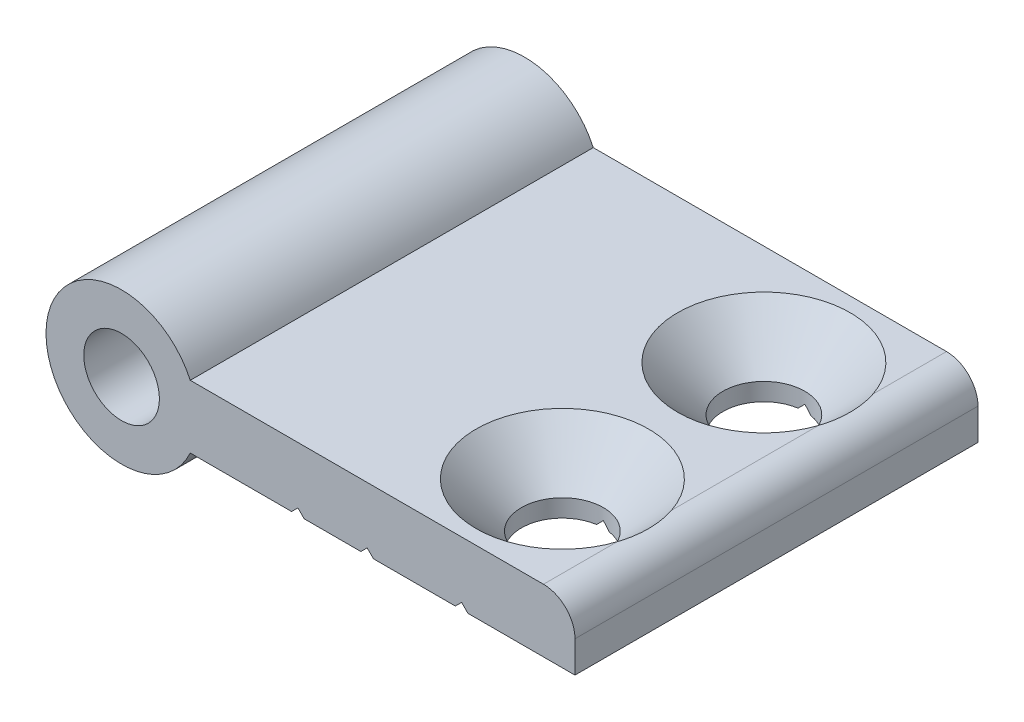
ISO-10303-21;
HEADER;
FILE_DESCRIPTION(('STEP AP214'),'2;1');
FILE_NAME('part.step','',(''),(''),'','','');
FILE_SCHEMA(('AUTOMOTIVE_DESIGN { 1 0 10303 214 1 1 1 1 }'));
ENDSEC;
DATA;
#1=APPLICATION_CONTEXT('core data for automotive mechanical design processes');
#2=APPLICATION_PROTOCOL_DEFINITION('international standard','automotive_design',2000,#1);
#3=PRODUCT_CONTEXT('',#1,'mechanical');
#4=PRODUCT('Part','Part','',(#3));
#5=PRODUCT_RELATED_PRODUCT_CATEGORY('part','',(#4));
#6=PRODUCT_DEFINITION_FORMATION('','',#4);
#7=PRODUCT_DEFINITION_CONTEXT('part definition',#1,'design');
#8=PRODUCT_DEFINITION('design','',#6,#7);
#9=PRODUCT_DEFINITION_SHAPE('','',#8);
#10=(LENGTH_UNIT() NAMED_UNIT(*) SI_UNIT(.MILLI.,.METRE.));
#11=(NAMED_UNIT(*) PLANE_ANGLE_UNIT() SI_UNIT($,.RADIAN.));
#12=(NAMED_UNIT(*) SI_UNIT($,.STERADIAN.) SOLID_ANGLE_UNIT());
#13=UNCERTAINTY_MEASURE_WITH_UNIT(LENGTH_MEASURE(1.E-05),#10,'distance_accuracy_value','');
#14=(GEOMETRIC_REPRESENTATION_CONTEXT(3) GLOBAL_UNCERTAINTY_ASSIGNED_CONTEXT((#13)) GLOBAL_UNIT_ASSIGNED_CONTEXT((#10,
#11,#12)) REPRESENTATION_CONTEXT('',''));
#15=CARTESIAN_POINT('',(0.,0.,0.));
#16=DIRECTION('',(0.,0.,1.));
#17=DIRECTION('',(1.,0.,0.));
#18=AXIS2_PLACEMENT_3D('',#15,#16,#17);
#19=CARTESIAN_POINT('',(19.,-2.5,0.));
#20=DIRECTION('',(0.707106781186547,-0.707106781186548,0.));
#21=DIRECTION('',(0.707106781186548,0.707106781186547,0.));
#22=AXIS2_PLACEMENT_3D('',#19,#20,#21);
#23=PLANE('',#22);
#24=DIRECTION('',(0.707106781186548,0.707106781186547,0.));
#25=VECTOR('',#24,1.);
#26=CARTESIAN_POINT('',(19.,-2.5,16.));
#27=LINE('',#26,#25);
#28=CARTESIAN_POINT('',(19.5,-2.,16.));
#29=VERTEX_POINT('',#28);
#30=CARTESIAN_POINT('',(19.,-2.5,16.));
#31=VERTEX_POINT('',#30);
#32=EDGE_CURVE('E248',#29,#31,#27,.F.);
#33=ORIENTED_EDGE('',*,*,#32,.T.);
#34=DIRECTION('',(0.,0.,-1.));
#35=VECTOR('',#34,1.);
#36=CARTESIAN_POINT('',(19.,-2.5,0.));
#37=LINE('',#36,#35);
#38=CARTESIAN_POINT('',(19.,-2.5,-16.));
#39=VERTEX_POINT('',#38);
#40=EDGE_CURVE('E139',#39,#31,#37,.F.);
#41=ORIENTED_EDGE('',*,*,#40,.F.);
#42=DIRECTION('',(0.707106781186548,0.707106781186547,0.));
#43=VECTOR('',#42,1.);
#44=CARTESIAN_POINT('',(19.,-2.5,-16.));
#45=LINE('',#44,#43);
#46=CARTESIAN_POINT('',(19.5,-2.,-16.));
#47=VERTEX_POINT('',#46);
#48=EDGE_CURVE('E252',#39,#47,#45,.T.);
#49=ORIENTED_EDGE('',*,*,#48,.T.);
#50=DIRECTION('',(0.,0.,1.));
#51=VECTOR('',#50,1.);
#52=CARTESIAN_POINT('',(19.5,-2.,0.));
#53=LINE('',#52,#51);
#54=EDGE_CURVE('E230',#29,#47,#53,.F.);
#55=ORIENTED_EDGE('',*,*,#54,.F.);
#56=EDGE_LOOP('',(#33,#41,#49,#55));
#57=FACE_BOUND('',#56,.T.);
#58=ADVANCED_FACE('F16',(#57),#23,.T.);
#59=CARTESIAN_POINT('',(14.,-2.,0.));
#60=DIRECTION('',(-0.707106781186547,-0.707106781186548,0.));
#61=DIRECTION('',(0.707106781186548,-0.707106781186547,0.));
#62=AXIS2_PLACEMENT_3D('',#59,#60,#61);
#63=PLANE('',#62);
#64=DIRECTION('',(0.707106781186548,-0.707106781186547,0.));
#65=VECTOR('',#64,1.);
#66=CARTESIAN_POINT('',(14.,-2.,16.));
#67=LINE('',#66,#65);
#68=CARTESIAN_POINT('',(14.5,-2.5,16.));
#69=VERTEX_POINT('',#68);
#70=CARTESIAN_POINT('',(14.,-2.,16.));
#71=VERTEX_POINT('',#70);
#72=EDGE_CURVE('E243',#69,#71,#67,.F.);
#73=ORIENTED_EDGE('',*,*,#72,.T.);
#74=DIRECTION('',(0.,0.,1.));
#75=VECTOR('',#74,1.);
#76=CARTESIAN_POINT('',(14.,-2.,0.));
#77=LINE('',#76,#75);
#78=CARTESIAN_POINT('',(14.,-2.,-16.));
#79=VERTEX_POINT('',#78);
#80=EDGE_CURVE('E145',#79,#71,#77,.T.);
#81=ORIENTED_EDGE('',*,*,#80,.F.);
#82=DIRECTION('',(0.707106781186548,-0.707106781186547,0.));
#83=VECTOR('',#82,1.);
#84=CARTESIAN_POINT('',(14.,-2.,-16.));
#85=LINE('',#84,#83);
#86=CARTESIAN_POINT('',(14.5,-2.5,-16.));
#87=VERTEX_POINT('',#86);
#88=EDGE_CURVE('E251',#79,#87,#85,.T.);
#89=ORIENTED_EDGE('',*,*,#88,.T.);
#90=DIRECTION('',(0.,0.,-1.));
#91=VECTOR('',#90,1.);
#92=CARTESIAN_POINT('',(14.5,-2.5,0.));
#93=LINE('',#92,#91);
#94=EDGE_CURVE('E136',#69,#87,#93,.T.);
#95=ORIENTED_EDGE('',*,*,#94,.F.);
#96=EDGE_LOOP('',(#73,#81,#89,#95));
#97=FACE_BOUND('',#96,.T.);
#98=ADVANCED_FACE('F356',(#97),#63,.T.);
#99=CARTESIAN_POINT('',(26.5,-2.5,0.));
#100=DIRECTION('',(0.707106781186549,-0.707106781186546,0.));
#101=DIRECTION('',(0.707106781186546,0.707106781186549,0.));
#102=AXIS2_PLACEMENT_3D('',#99,#100,#101);
#103=PLANE('',#102);
#104=CARTESIAN_POINT('',(27.,-2.,8.));
#105=DIRECTION('',(0.707106781186549,-0.707106781186546,0.));
#106=DIRECTION('',(-0.707106781186546,-0.707106781186549,0.));
#107=AXIS2_PLACEMENT_3D('',#104,#105,#106);
#108=ELLIPSE('',#107,4.59619407771257,3.25);
#109=CARTESIAN_POINT('',(27.,-2.,4.75));
#110=VERTEX_POINT('',#109);
#111=CARTESIAN_POINT('',(26.5,-2.5,4.78869185533372));
#112=VERTEX_POINT('',#111);
#113=EDGE_CURVE('E126',#110,#112,#108,.F.);
#114=ORIENTED_EDGE('',*,*,#113,.T.);
#115=DIRECTION('',(0.,0.,-1.));
#116=VECTOR('',#115,1.);
#117=CARTESIAN_POINT('',(26.5,-2.5,0.));
#118=LINE('',#117,#116);
#119=CARTESIAN_POINT('',(26.5,-2.5,-4.78869185533371));
#120=VERTEX_POINT('',#119);
#121=EDGE_CURVE('E123',#120,#112,#118,.F.);
#122=ORIENTED_EDGE('',*,*,#121,.F.);
#123=CARTESIAN_POINT('',(27.,-2.,-8.));
#124=DIRECTION('',(0.707106781186549,-0.707106781186546,0.));
#125=DIRECTION('',(-0.707106781186546,-0.707106781186549,0.));
#126=AXIS2_PLACEMENT_3D('',#123,#124,#125);
#127=ELLIPSE('',#126,4.59619407771257,3.25);
#128=CARTESIAN_POINT('',(27.,-2.,-4.75));
#129=VERTEX_POINT('',#128);
#130=EDGE_CURVE('E21',#120,#129,#127,.F.);
#131=ORIENTED_EDGE('',*,*,#130,.T.);
#132=DIRECTION('',(0.,0.,1.));
#133=VECTOR('',#132,1.);
#134=CARTESIAN_POINT('',(27.,-2.,0.));
#135=LINE('',#134,#133);
#136=EDGE_CURVE('E121',#110,#129,#135,.F.);
#137=ORIENTED_EDGE('',*,*,#136,.F.);
#138=EDGE_LOOP('',(#114,#122,#131,#137));
#139=FACE_BOUND('',#138,.T.);
#140=ADVANCED_FACE('F124',(#139),#103,.T.);
#141=CARTESIAN_POINT('',(26.5,-2.5,0.));
#142=DIRECTION('',(0.707106781186549,-0.707106781186546,0.));
#143=DIRECTION('',(0.707106781186546,0.707106781186549,0.));
#144=AXIS2_PLACEMENT_3D('',#141,#142,#143);
#145=PLANE('',#144);
#146=DIRECTION('',(0.707106781186546,0.707106781186549,0.));
#147=VECTOR('',#146,1.);
#148=CARTESIAN_POINT('',(26.5,-2.5,16.));
#149=LINE('',#148,#147);
#150=CARTESIAN_POINT('',(27.,-2.,16.));
#151=VERTEX_POINT('',#150);
#152=CARTESIAN_POINT('',(26.5,-2.5,16.));
#153=VERTEX_POINT('',#152);
#154=EDGE_CURVE('E240',#151,#153,#149,.F.);
#155=ORIENTED_EDGE('',*,*,#154,.T.);
#156=DIRECTION('',(0.,0.,-1.));
#157=VECTOR('',#156,1.);
#158=CARTESIAN_POINT('',(26.5,-2.5,0.));
#159=LINE('',#158,#157);
#160=CARTESIAN_POINT('',(26.5,-2.5,11.2113081446663));
#161=VERTEX_POINT('',#160);
#162=EDGE_CURVE('E189',#161,#153,#159,.F.);
#163=ORIENTED_EDGE('',*,*,#162,.F.);
#164=CARTESIAN_POINT('',(27.,-2.,8.));
#165=DIRECTION('',(0.707106781186549,-0.707106781186546,0.));
#166=DIRECTION('',(-0.707106781186546,-0.707106781186549,0.));
#167=AXIS2_PLACEMENT_3D('',#164,#165,#166);
#168=ELLIPSE('',#167,4.59619407771257,3.25);
#169=CARTESIAN_POINT('',(27.,-2.,11.25));
#170=VERTEX_POINT('',#169);
#171=EDGE_CURVE('E151',#161,#170,#168,.F.);
#172=ORIENTED_EDGE('',*,*,#171,.T.);
#173=DIRECTION('',(0.,0.,1.));
#174=VECTOR('',#173,1.);
#175=CARTESIAN_POINT('',(27.,-2.,0.));
#176=LINE('',#175,#174);
#177=EDGE_CURVE('E215',#151,#170,#176,.F.);
#178=ORIENTED_EDGE('',*,*,#177,.F.);
#179=EDGE_LOOP('',(#155,#163,#172,#178));
#180=FACE_BOUND('',#179,.T.);
#181=ADVANCED_FACE('F349',(#180),#145,.T.);
#182=CARTESIAN_POINT('',(19.5,-2.,0.));
#183=DIRECTION('',(-0.707106781186546,-0.707106781186549,0.));
#184=DIRECTION('',(0.707106781186549,-0.707106781186546,0.));
#185=AXIS2_PLACEMENT_3D('',#182,#183,#184);
#186=PLANE('',#185);
#187=DIRECTION('',(0.707106781186549,-0.707106781186546,0.));
#188=VECTOR('',#187,1.);
#189=CARTESIAN_POINT('',(19.5,-2.,16.));
#190=LINE('',#189,#188);
#191=CARTESIAN_POINT('',(20.,-2.5,16.));
#192=VERTEX_POINT('',#191);
#193=EDGE_CURVE('E234',#192,#29,#190,.F.);
#194=ORIENTED_EDGE('',*,*,#193,.T.);
#195=ORIENTED_EDGE('',*,*,#54,.T.);
#196=DIRECTION('',(0.707106781186549,-0.707106781186546,0.));
#197=VECTOR('',#196,1.);
#198=CARTESIAN_POINT('',(19.5,-2.,-16.));
#199=LINE('',#198,#197);
#200=CARTESIAN_POINT('',(20.,-2.5,-16.));
#201=VERTEX_POINT('',#200);
#202=EDGE_CURVE('E237',#47,#201,#199,.T.);
#203=ORIENTED_EDGE('',*,*,#202,.T.);
#204=DIRECTION('',(0.,0.,-1.));
#205=VECTOR('',#204,1.);
#206=CARTESIAN_POINT('',(20.,-2.5,0.));
#207=LINE('',#206,#205);
#208=EDGE_CURVE('E186',#192,#201,#207,.T.);
#209=ORIENTED_EDGE('',*,*,#208,.F.);
#210=EDGE_LOOP('',(#194,#195,#203,#209));
#211=FACE_BOUND('',#210,.T.);
#212=ADVANCED_FACE('F345',(#211),#186,.T.);
#213=CARTESIAN_POINT('',(26.5,-2.5,0.));
#214=DIRECTION('',(0.707106781186549,-0.707106781186546,0.));
#215=DIRECTION('',(0.707106781186546,0.707106781186549,0.));
#216=AXIS2_PLACEMENT_3D('',#213,#214,#215);
#217=PLANE('',#216);
#218=DIRECTION('',(0.707106781186546,0.707106781186549,0.));
#219=VECTOR('',#218,1.);
#220=CARTESIAN_POINT('',(26.5,-2.5,-16.));
#221=LINE('',#220,#219);
#222=CARTESIAN_POINT('',(26.5,-2.5,-16.));
#223=VERTEX_POINT('',#222);
#224=CARTESIAN_POINT('',(27.,-2.,-16.));
#225=VERTEX_POINT('',#224);
#226=EDGE_CURVE('E225',#223,#225,#221,.T.);
#227=ORIENTED_EDGE('',*,*,#226,.T.);
#228=DIRECTION('',(0.,0.,1.));
#229=VECTOR('',#228,1.);
#230=CARTESIAN_POINT('',(27.,-2.,0.));
#231=LINE('',#230,#229);
#232=CARTESIAN_POINT('',(27.,-2.,-11.25));
#233=VERTEX_POINT('',#232);
#234=EDGE_CURVE('E222',#233,#225,#231,.F.);
#235=ORIENTED_EDGE('',*,*,#234,.F.);
#236=CARTESIAN_POINT('',(27.,-2.,-8.));
#237=DIRECTION('',(0.707106781186549,-0.707106781186546,0.));
#238=DIRECTION('',(-0.707106781186546,-0.707106781186549,0.));
#239=AXIS2_PLACEMENT_3D('',#236,#237,#238);
#240=ELLIPSE('',#239,4.59619407771257,3.25);
#241=CARTESIAN_POINT('',(26.5,-2.5,-11.2113081446663));
#242=VERTEX_POINT('',#241);
#243=EDGE_CURVE('E153',#233,#242,#240,.F.);
#244=ORIENTED_EDGE('',*,*,#243,.T.);
#245=DIRECTION('',(0.,0.,-1.));
#246=VECTOR('',#245,1.);
#247=CARTESIAN_POINT('',(26.5,-2.5,0.));
#248=LINE('',#247,#246);
#249=EDGE_CURVE('E135',#223,#242,#248,.F.);
#250=ORIENTED_EDGE('',*,*,#249,.F.);
#251=EDGE_LOOP('',(#227,#235,#244,#250));
#252=FACE_BOUND('',#251,.T.);
#253=ADVANCED_FACE('F341',(#252),#217,.T.);
#254=CARTESIAN_POINT('',(27.,-2.,0.));
#255=DIRECTION('',(-0.707106781186549,-0.707106781186546,0.));
#256=DIRECTION('',(0.707106781186546,-0.707106781186549,0.));
#257=AXIS2_PLACEMENT_3D('',#254,#255,#256);
#258=PLANE('',#257);
#259=DIRECTION('',(0.707106781186546,-0.707106781186549,0.));
#260=VECTOR('',#259,1.);
#261=CARTESIAN_POINT('',(27.,-2.,-16.));
#262=LINE('',#261,#260);
#263=CARTESIAN_POINT('',(27.5,-2.5,-16.));
#264=VERTEX_POINT('',#263);
#265=EDGE_CURVE('E221',#225,#264,#262,.T.);
#266=ORIENTED_EDGE('',*,*,#265,.T.);
#267=DIRECTION('',(0.,0.,-1.));
#268=VECTOR('',#267,1.);
#269=CARTESIAN_POINT('',(27.5,-2.5,0.));
#270=LINE('',#269,#268);
#271=CARTESIAN_POINT('',(27.5,-2.5,-11.2113081446663));
#272=VERTEX_POINT('',#271);
#273=EDGE_CURVE('E168',#272,#264,#270,.T.);
#274=ORIENTED_EDGE('',*,*,#273,.F.);
#275=CARTESIAN_POINT('',(27.,-2.,-8.));
#276=DIRECTION('',(-0.707106781186549,-0.707106781186546,0.));
#277=DIRECTION('',(0.707106781186546,-0.707106781186549,0.));
#278=AXIS2_PLACEMENT_3D('',#275,#276,#277);
#279=ELLIPSE('',#278,4.59619407771257,3.25);
#280=EDGE_CURVE('E155',#272,#233,#279,.F.);
#281=ORIENTED_EDGE('',*,*,#280,.T.);
#282=ORIENTED_EDGE('',*,*,#234,.T.);
#283=EDGE_LOOP('',(#266,#274,#281,#282));
#284=FACE_BOUND('',#283,.T.);
#285=ADVANCED_FACE('F337',(#284),#258,.T.);
#286=CARTESIAN_POINT('',(27.,-2.,0.));
#287=DIRECTION('',(-0.707106781186549,-0.707106781186546,0.));
#288=DIRECTION('',(0.707106781186546,-0.707106781186549,0.));
#289=AXIS2_PLACEMENT_3D('',#286,#287,#288);
#290=PLANE('',#289);
#291=DIRECTION('',(0.707106781186546,-0.707106781186549,0.));
#292=VECTOR('',#291,1.);
#293=CARTESIAN_POINT('',(27.,-2.,16.));
#294=LINE('',#293,#292);
#295=CARTESIAN_POINT('',(27.5,-2.5,16.));
#296=VERTEX_POINT('',#295);
#297=EDGE_CURVE('E218',#296,#151,#294,.F.);
#298=ORIENTED_EDGE('',*,*,#297,.T.);
#299=ORIENTED_EDGE('',*,*,#177,.T.);
#300=CARTESIAN_POINT('',(27.,-2.,8.));
#301=DIRECTION('',(-0.707106781186549,-0.707106781186546,0.));
#302=DIRECTION('',(0.707106781186546,-0.707106781186549,0.));
#303=AXIS2_PLACEMENT_3D('',#300,#301,#302);
#304=ELLIPSE('',#303,4.59619407771257,3.25);
#305=CARTESIAN_POINT('',(27.5,-2.5,11.2113081446663));
#306=VERTEX_POINT('',#305);
#307=EDGE_CURVE('E149',#170,#306,#304,.F.);
#308=ORIENTED_EDGE('',*,*,#307,.T.);
#309=DIRECTION('',(0.,0.,-1.));
#310=VECTOR('',#309,1.);
#311=CARTESIAN_POINT('',(27.5,-2.5,0.));
#312=LINE('',#311,#310);
#313=EDGE_CURVE('E178',#296,#306,#312,.T.);
#314=ORIENTED_EDGE('',*,*,#313,.F.);
#315=EDGE_LOOP('',(#298,#299,#308,#314));
#316=FACE_BOUND('',#315,.T.);
#317=ADVANCED_FACE('F334',(#316),#290,.T.);
#318=CARTESIAN_POINT('',(27.,-2.,0.));
#319=DIRECTION('',(-0.707106781186549,-0.707106781186546,0.));
#320=DIRECTION('',(0.707106781186546,-0.707106781186549,0.));
#321=AXIS2_PLACEMENT_3D('',#318,#319,#320);
#322=PLANE('',#321);
#323=CARTESIAN_POINT('',(27.,-2.,8.));
#324=DIRECTION('',(-0.707106781186549,-0.707106781186546,0.));
#325=DIRECTION('',(0.707106781186546,-0.707106781186549,0.));
#326=AXIS2_PLACEMENT_3D('',#323,#324,#325);
#327=ELLIPSE('',#326,4.59619407771257,3.25);
#328=CARTESIAN_POINT('',(27.5,-2.5,4.78869185533372));
#329=VERTEX_POINT('',#328);
#330=EDGE_CURVE('E146',#329,#110,#327,.F.);
#331=ORIENTED_EDGE('',*,*,#330,.T.);
#332=ORIENTED_EDGE('',*,*,#136,.T.);
#333=CARTESIAN_POINT('',(27.,-2.,-8.));
#334=DIRECTION('',(-0.707106781186549,-0.707106781186546,0.));
#335=DIRECTION('',(0.707106781186546,-0.707106781186549,0.));
#336=AXIS2_PLACEMENT_3D('',#333,#334,#335);
#337=ELLIPSE('',#336,4.59619407771257,3.25);
#338=CARTESIAN_POINT('',(27.5,-2.5,-4.78869185533371));
#339=VERTEX_POINT('',#338);
#340=EDGE_CURVE('E118',#129,#339,#337,.F.);
#341=ORIENTED_EDGE('',*,*,#340,.T.);
#342=DIRECTION('',(0.,0.,-1.));
#343=VECTOR('',#342,1.);
#344=CARTESIAN_POINT('',(27.5,-2.5,0.));
#345=LINE('',#344,#343);
#346=EDGE_CURVE('E161',#329,#339,#345,.T.);
#347=ORIENTED_EDGE('',*,*,#346,.F.);
#348=EDGE_LOOP('',(#331,#332,#341,#347));
#349=FACE_BOUND('',#348,.T.);
#350=ADVANCED_FACE('F159',(#349),#322,.T.);
#351=CARTESIAN_POINT('',(27.,-1.09999999999999,-8.));
#352=DIRECTION('',(0.,-1.,0.));
#353=DIRECTION('',(0.,0.,-1.));
#354=AXIS2_PLACEMENT_3D('',#351,#352,#353);
#355=CYLINDRICAL_SURFACE('',#354,3.25);
#356=CARTESIAN_POINT('',(27.,-1.1,-8.));
#357=DIRECTION('',(0.,1.,0.));
#358=DIRECTION('',(0.,0.,1.));
#359=AXIS2_PLACEMENT_3D('',#356,#357,#358);
#360=CIRCLE('',#359,3.25);
#361=CARTESIAN_POINT('',(27.,-1.1,-4.75));
#362=VERTEX_POINT('',#361);
#363=EDGE_CURVE('E176',#362,#362,#360,.T.);
#364=ORIENTED_EDGE('',*,*,#363,.T.);
#365=EDGE_LOOP('',(#364));
#366=FACE_BOUND('',#365,.T.);
#367=ORIENTED_EDGE('',*,*,#243,.F.);
#368=ORIENTED_EDGE('',*,*,#280,.F.);
#369=CARTESIAN_POINT('',(27.,-2.5,-8.));
#370=DIRECTION('',(0.,-1.,0.));
#371=DIRECTION('',(0.,0.,-1.));
#372=AXIS2_PLACEMENT_3D('',#369,#370,#371);
#373=CIRCLE('',#372,3.25);
#374=EDGE_CURVE('E164',#339,#272,#373,.F.);
#375=ORIENTED_EDGE('',*,*,#374,.F.);
#376=ORIENTED_EDGE('',*,*,#340,.F.);
#377=ORIENTED_EDGE('',*,*,#130,.F.);
#378=CARTESIAN_POINT('',(27.,-2.5,-8.));
#379=DIRECTION('',(0.,-1.,0.));
#380=DIRECTION('',(0.,0.,-1.));
#381=AXIS2_PLACEMENT_3D('',#378,#379,#380);
#382=CIRCLE('',#381,3.25);
#383=EDGE_CURVE('E115',#242,#120,#382,.F.);
#384=ORIENTED_EDGE('',*,*,#383,.F.);
#385=EDGE_LOOP('',(#367,#368,#375,#376,#377,#384));
#386=FACE_BOUND('',#385,.T.);
#387=ADVANCED_FACE('F113',(#366,#386),#355,.F.);
#388=CARTESIAN_POINT('',(27.,-1.09999999999999,8.));
#389=DIRECTION('',(0.,-1.,0.));
#390=DIRECTION('',(0.,0.,-1.));
#391=AXIS2_PLACEMENT_3D('',#388,#389,#390);
#392=CYLINDRICAL_SURFACE('',#391,3.25);
#393=CARTESIAN_POINT('',(27.,-1.1,8.));
#394=DIRECTION('',(0.,1.,0.));
#395=DIRECTION('',(0.,0.,1.));
#396=AXIS2_PLACEMENT_3D('',#393,#394,#395);
#397=CIRCLE('',#396,3.25);
#398=CARTESIAN_POINT('',(27.,-1.1,11.25));
#399=VERTEX_POINT('',#398);
#400=EDGE_CURVE('E417',#399,#399,#397,.T.);
#401=ORIENTED_EDGE('',*,*,#400,.T.);
#402=EDGE_LOOP('',(#401));
#403=FACE_BOUND('',#402,.T.);
#404=ORIENTED_EDGE('',*,*,#113,.F.);
#405=ORIENTED_EDGE('',*,*,#330,.F.);
#406=CARTESIAN_POINT('',(27.,-2.5,8.));
#407=DIRECTION('',(0.,-1.,0.));
#408=DIRECTION('',(0.,0.,-1.));
#409=AXIS2_PLACEMENT_3D('',#406,#407,#408);
#410=CIRCLE('',#409,3.25);
#411=EDGE_CURVE('E172',#306,#329,#410,.F.);
#412=ORIENTED_EDGE('',*,*,#411,.F.);
#413=ORIENTED_EDGE('',*,*,#307,.F.);
#414=ORIENTED_EDGE('',*,*,#171,.F.);
#415=CARTESIAN_POINT('',(27.,-2.5,8.));
#416=DIRECTION('',(0.,-1.,0.));
#417=DIRECTION('',(0.,0.,-1.));
#418=AXIS2_PLACEMENT_3D('',#415,#416,#417);
#419=CIRCLE('',#418,3.25);
#420=EDGE_CURVE('E130',#112,#161,#419,.F.);
#421=ORIENTED_EDGE('',*,*,#420,.F.);
#422=EDGE_LOOP('',(#404,#405,#412,#413,#414,#421));
#423=FACE_BOUND('',#422,.T.);
#424=ADVANCED_FACE('F330',(#403,#423),#392,.F.);
#425=CARTESIAN_POINT('',(13.5,-2.5,0.));
#426=DIRECTION('',(0.707106781186547,-0.707106781186548,0.));
#427=DIRECTION('',(0.707106781186548,0.707106781186547,0.));
#428=AXIS2_PLACEMENT_3D('',#425,#426,#427);
#429=PLANE('',#428);
#430=DIRECTION('',(0.707106781186548,0.707106781186547,0.));
#431=VECTOR('',#430,1.);
#432=CARTESIAN_POINT('',(13.5,-2.5,16.));
#433=LINE('',#432,#431);
#434=CARTESIAN_POINT('',(13.5,-2.5,16.));
#435=VERTEX_POINT('',#434);
#436=EDGE_CURVE('E194',#71,#435,#433,.F.);
#437=ORIENTED_EDGE('',*,*,#436,.T.);
#438=DIRECTION('',(0.,0.,-1.));
#439=VECTOR('',#438,1.);
#440=CARTESIAN_POINT('',(13.5,-2.5,0.));
#441=LINE('',#440,#439);
#442=CARTESIAN_POINT('',(13.5,-2.5,-16.));
#443=VERTEX_POINT('',#442);
#444=EDGE_CURVE('E195',#443,#435,#441,.F.);
#445=ORIENTED_EDGE('',*,*,#444,.F.);
#446=DIRECTION('',(0.707106781186549,0.707106781186546,0.));
#447=VECTOR('',#446,1.);
#448=CARTESIAN_POINT('',(13.5,-2.5,-16.));
#449=LINE('',#448,#447);
#450=EDGE_CURVE('E202',#443,#79,#449,.T.);
#451=ORIENTED_EDGE('',*,*,#450,.T.);
#452=ORIENTED_EDGE('',*,*,#80,.T.);
#453=EDGE_LOOP('',(#437,#445,#451,#452));
#454=FACE_BOUND('',#453,.T.);
#455=ADVANCED_FACE('F326',(#454),#429,.T.);
#456=CARTESIAN_POINT('',(14.5,-2.5,0.));
#457=DIRECTION('',(0.,-1.,0.));
#458=DIRECTION('',(0.,0.,-1.));
#459=AXIS2_PLACEMENT_3D('',#456,#457,#458);
#460=PLANE('',#459);
#461=DIRECTION('',(1.,0.,0.));
#462=VECTOR('',#461,1.);
#463=CARTESIAN_POINT('',(14.3886766748367,-2.5,16.));
#464=LINE('',#463,#462);
#465=EDGE_CURVE('E247',#69,#31,#464,.T.);
#466=ORIENTED_EDGE('',*,*,#465,.F.);
#467=ORIENTED_EDGE('',*,*,#94,.T.);
#468=DIRECTION('',(1.,0.,0.));
#469=VECTOR('',#468,1.);
#470=CARTESIAN_POINT('',(14.3886766748367,-2.5,-16.));
#471=LINE('',#470,#469);
#472=EDGE_CURVE('E205',#87,#39,#471,.T.);
#473=ORIENTED_EDGE('',*,*,#472,.T.);
#474=ORIENTED_EDGE('',*,*,#40,.T.);
#475=EDGE_LOOP('',(#466,#467,#473,#474));
#476=FACE_BOUND('',#475,.T.);
#477=ADVANCED_FACE('F323',(#476),#460,.T.);
#478=CARTESIAN_POINT('',(20.,-2.5,0.));
#479=DIRECTION('',(0.,-1.,0.));
#480=DIRECTION('',(0.,0.,-1.));
#481=AXIS2_PLACEMENT_3D('',#478,#479,#480);
#482=PLANE('',#481);
#483=DIRECTION('',(1.,0.,0.));
#484=VECTOR('',#483,1.);
#485=CARTESIAN_POINT('',(14.3886766748367,-2.5,-16.));
#486=LINE('',#485,#484);
#487=EDGE_CURVE('E211',#201,#223,#486,.T.);
#488=ORIENTED_EDGE('',*,*,#487,.T.);
#489=ORIENTED_EDGE('',*,*,#249,.T.);
#490=ORIENTED_EDGE('',*,*,#383,.T.);
#491=ORIENTED_EDGE('',*,*,#121,.T.);
#492=ORIENTED_EDGE('',*,*,#420,.T.);
#493=ORIENTED_EDGE('',*,*,#162,.T.);
#494=DIRECTION('',(1.,0.,0.));
#495=VECTOR('',#494,1.);
#496=CARTESIAN_POINT('',(14.3886766748367,-2.5,16.));
#497=LINE('',#496,#495);
#498=EDGE_CURVE('E244',#192,#153,#497,.T.);
#499=ORIENTED_EDGE('',*,*,#498,.F.);
#500=ORIENTED_EDGE('',*,*,#208,.T.);
#501=EDGE_LOOP('',(#488,#489,#490,#491,#492,#493,#499,#500));
#502=FACE_BOUND('',#501,.T.);
#503=ADVANCED_FACE('F133',(#502),#482,.T.);
#504=CARTESIAN_POINT('',(27.5,-2.5,0.));
#505=DIRECTION('',(0.,-1.,0.));
#506=DIRECTION('',(0.,0.,-1.));
#507=AXIS2_PLACEMENT_3D('',#504,#505,#506);
#508=PLANE('',#507);
#509=ORIENTED_EDGE('',*,*,#411,.T.);
#510=ORIENTED_EDGE('',*,*,#346,.T.);
#511=ORIENTED_EDGE('',*,*,#374,.T.);
#512=ORIENTED_EDGE('',*,*,#273,.T.);
#513=DIRECTION('',(1.,0.,0.));
#514=VECTOR('',#513,1.);
#515=CARTESIAN_POINT('',(14.3886766748367,-2.5,-16.));
#516=LINE('',#515,#514);
#517=CARTESIAN_POINT('',(36.,-2.5,-16.));
#518=VERTEX_POINT('',#517);
#519=EDGE_CURVE('E207',#264,#518,#516,.T.);
#520=ORIENTED_EDGE('',*,*,#519,.T.);
#521=DIRECTION('',(0.,0.,-1.));
#522=VECTOR('',#521,1.);
#523=CARTESIAN_POINT('',(36.,-2.5,0.));
#524=LINE('',#523,#522);
#525=CARTESIAN_POINT('',(36.,-2.5,16.));
#526=VERTEX_POINT('',#525);
#527=EDGE_CURVE('E173',#526,#518,#524,.T.);
#528=ORIENTED_EDGE('',*,*,#527,.F.);
#529=DIRECTION('',(1.,0.,0.));
#530=VECTOR('',#529,1.);
#531=CARTESIAN_POINT('',(14.3886766748367,-2.5,16.));
#532=LINE('',#531,#530);
#533=EDGE_CURVE('E182',#296,#526,#532,.T.);
#534=ORIENTED_EDGE('',*,*,#533,.F.);
#535=ORIENTED_EDGE('',*,*,#313,.T.);
#536=EDGE_LOOP('',(#509,#510,#511,#512,#520,#528,#534,#535));
#537=FACE_BOUND('',#536,.T.);
#538=ADVANCED_FACE('F169',(#537),#508,.T.);
#539=CARTESIAN_POINT('',(36.,-2.5,0.));
#540=DIRECTION('',(1.,0.,0.));
#541=DIRECTION('',(0.,0.,-1.));
#542=AXIS2_PLACEMENT_3D('',#539,#540,#541);
#543=PLANE('',#542);
#544=DIRECTION('',(0.,1.,0.));
#545=VECTOR('',#544,1.);
#546=CARTESIAN_POINT('',(36.,-0.053688417283162,16.));
#547=LINE('',#546,#545);
#548=CARTESIAN_POINT('',(36.,0.,16.));
#549=VERTEX_POINT('',#548);
#550=EDGE_CURVE('E283',#526,#549,#547,.T.);
#551=ORIENTED_EDGE('',*,*,#550,.F.);
#552=ORIENTED_EDGE('',*,*,#527,.T.);
#553=DIRECTION('',(0.,1.,0.));
#554=VECTOR('',#553,1.);
#555=CARTESIAN_POINT('',(36.,-0.053688417283162,-16.));
#556=LINE('',#555,#554);
#557=CARTESIAN_POINT('',(36.,0.,-16.));
#558=VERTEX_POINT('',#557);
#559=EDGE_CURVE('E210',#518,#558,#556,.T.);
#560=ORIENTED_EDGE('',*,*,#559,.T.);
#561=DIRECTION('',(0.,0.,-1.));
#562=VECTOR('',#561,1.);
#563=CARTESIAN_POINT('',(36.,0.,0.));
#564=LINE('',#563,#562);
#565=EDGE_CURVE('E206',#549,#558,#564,.T.);
#566=ORIENTED_EDGE('',*,*,#565,.F.);
#567=EDGE_LOOP('',(#551,#552,#560,#566));
#568=FACE_BOUND('',#567,.T.);
#569=ADVANCED_FACE('F314',(#568),#543,.T.);
#570=CARTESIAN_POINT('',(0.,0.,0.));
#571=DIRECTION('',(0.,0.,-1.));
#572=DIRECTION('',(-1.,0.,0.));
#573=AXIS2_PLACEMENT_3D('',#570,#571,#572);
#574=CYLINDRICAL_SURFACE('',#573,3.);
#575=CARTESIAN_POINT('',(0.,0.,-16.));
#576=DIRECTION('',(0.,0.,-1.));
#577=DIRECTION('',(-1.,0.,0.));
#578=AXIS2_PLACEMENT_3D('',#575,#576,#577);
#579=CIRCLE('',#578,3.);
#580=CARTESIAN_POINT('',(-3.,0.,-16.));
#581=VERTEX_POINT('',#580);
#582=EDGE_CURVE('E284',#581,#581,#579,.T.);
#583=ORIENTED_EDGE('',*,*,#582,.T.);
#584=EDGE_LOOP('',(#583));
#585=FACE_BOUND('',#584,.T.);
#586=CARTESIAN_POINT('',(0.,0.,16.));
#587=DIRECTION('',(0.,0.,-1.));
#588=DIRECTION('',(-1.,0.,0.));
#589=AXIS2_PLACEMENT_3D('',#586,#587,#588);
#590=CIRCLE('',#589,3.);
#591=CARTESIAN_POINT('',(-3.,0.,16.));
#592=VERTEX_POINT('',#591);
#593=EDGE_CURVE('E278',#592,#592,#590,.T.);
#594=ORIENTED_EDGE('',*,*,#593,.F.);
#595=EDGE_LOOP('',(#594));
#596=FACE_BOUND('',#595,.T.);
#597=ADVANCED_FACE('F309',(#585,#596),#574,.F.);
#598=CARTESIAN_POINT('',(27.,2.5,-8.));
#599=DIRECTION('',(0.,1.,0.));
#600=DIRECTION('',(0.,0.,1.));
#601=AXIS2_PLACEMENT_3D('',#598,#599,#600);
#602=CONICAL_SURFACE('',#601,6.85,0.785398163397449);
#603=ORIENTED_EDGE('',*,*,#363,.F.);
#604=EDGE_LOOP('',(#603));
#605=FACE_BOUND('',#604,.T.);
#606=CARTESIAN_POINT('',(27.,2.5,-8.));
#607=DIRECTION('',(0.,1.,0.));
#608=DIRECTION('',(0.,0.,1.));
#609=AXIS2_PLACEMENT_3D('',#606,#607,#608);
#610=CIRCLE('',#609,6.85);
#611=CARTESIAN_POINT('',(33.5,2.5,-5.83840336787828));
#612=VERTEX_POINT('',#611);
#613=CARTESIAN_POINT('',(33.5,2.5,-10.1615966321217));
#614=VERTEX_POINT('',#613);
#615=EDGE_CURVE('E274',#612,#614,#610,.F.);
#616=ORIENTED_EDGE('',*,*,#615,.F.);
#617=CARTESIAN_POINT('',(33.5,2.5,-10.1615966321217));
#618=CARTESIAN_POINT('',(33.5284854953985,2.49998413686564,-10.075892504031));
#619=CARTESIAN_POINT('',(33.5548362124665,2.49951308747453,-9.98949965534697));
#620=CARTESIAN_POINT('',(33.6035194794252,2.49797862949295,-9.81562252741324));
#621=CARTESIAN_POINT('',(33.6258533665827,2.49691541852724,-9.72813862180432));
#622=CARTESIAN_POINT('',(33.6667449913902,2.4945158608883,-9.55242830860069));
#623=CARTESIAN_POINT('',(33.685307859915,2.49317989036704,-9.46420308229175));
#624=CARTESIAN_POINT('',(33.7188836665458,2.4904562532728,-9.28707800728814));
#625=CARTESIAN_POINT('',(33.733896266579,2.48906858179118,-9.19817809517807));
#626=CARTESIAN_POINT('',(33.7732591568449,2.48516247725169,-8.93460537823119));
#627=CARTESIAN_POINT('',(33.7928130238934,2.48283149126358,-8.75919425524095));
#628=CARTESIAN_POINT('',(33.8196416112109,2.47951667363616,-8.40735458908126));
#629=CARTESIAN_POINT('',(33.826909362067,2.47853360667605,-8.23092552537075));
#630=CARTESIAN_POINT('',(33.8294580719379,2.47819738229212,-7.86911513900038));
#631=CARTESIAN_POINT('',(33.8241188363872,2.47892854307829,-7.68372911950164));
#632=CARTESIAN_POINT('',(33.7999579972102,2.48197138505783,-7.31391500741253));
#633=CARTESIAN_POINT('',(33.781143324256,2.48428225374975,-7.12948647146441));
#634=CARTESIAN_POINT('',(33.7419546210056,2.48829763660098,-6.85224055165586));
#635=CARTESIAN_POINT('',(33.7268264320395,2.4897473784936,-6.75865643981741));
#636=CARTESIAN_POINT('',(33.6926732553632,2.49262354461978,-6.57220470692549));
#637=CARTESIAN_POINT('',(33.6736486759123,2.49404997127938,-6.47933701186367));
#638=CARTESIAN_POINT('',(33.6314638210351,2.49663198447792,-6.29440294435852));
#639=CARTESIAN_POINT('',(33.6082979812732,2.49778720171914,-6.20233782702811));
#640=CARTESIAN_POINT('',(33.5575417808061,2.49946175696113,-6.01939638028011));
#641=CARTESIAN_POINT('',(33.5299497876467,2.49998085973752,-5.92852050290506));
#642=CARTESIAN_POINT('',(33.5,2.5,-5.83840336787826));
#643=B_SPLINE_CURVE_WITH_KNOTS('',3,(#617,#618,#619,#620,#621,#622,#623,#624,#625,#626,#627,
#628,#629,#630,#631,#632,#633,#634,#635,#636,#637,#638,#639,#640,#641,#642),.UNSPECIFIED.,.F.,
.F.,(4,2,2,2,2,2,2,2,2,2,2,2,4),(0.,0.270884240078315,0.541678130864511,0.812101072758888,
1.08254975520108,1.61158507054597,2.14092038547559,2.69683426870737,3.25246244005164,
3.53682490289298,3.82115758578741,4.10587521901782,4.39069810428501),.UNSPECIFIED.);
#644=EDGE_CURVE('E296',#614,#612,#643,.T.);
#645=ORIENTED_EDGE('',*,*,#644,.F.);
#646=EDGE_LOOP('',(#616,#645));
#647=FACE_BOUND('',#646,.T.);
#648=ADVANCED_FACE('F313',(#605,#647),#602,.F.);
#649=CARTESIAN_POINT('',(27.,2.5,8.));
#650=DIRECTION('',(0.,1.,0.));
#651=DIRECTION('',(0.,0.,1.));
#652=AXIS2_PLACEMENT_3D('',#649,#650,#651);
#653=CONICAL_SURFACE('',#652,6.85,0.785398163397449);
#654=ORIENTED_EDGE('',*,*,#400,.F.);
#655=EDGE_LOOP('',(#654));
#656=FACE_BOUND('',#655,.T.);
#657=CARTESIAN_POINT('',(27.,2.5,8.));
#658=DIRECTION('',(0.,1.,0.));
#659=DIRECTION('',(0.,0.,1.));
#660=AXIS2_PLACEMENT_3D('',#657,#658,#659);
#661=CIRCLE('',#660,6.85);
#662=CARTESIAN_POINT('',(33.5,2.5,10.1615966321217));
#663=VERTEX_POINT('',#662);
#664=CARTESIAN_POINT('',(33.5,2.5,5.83840336787827));
#665=VERTEX_POINT('',#664);
#666=EDGE_CURVE('E270',#663,#665,#661,.F.);
#667=ORIENTED_EDGE('',*,*,#666,.F.);
#668=CARTESIAN_POINT('',(33.5,2.5,5.83840336787827));
#669=CARTESIAN_POINT('',(33.5284854953985,2.49998413686564,5.92410749596898));
#670=CARTESIAN_POINT('',(33.5548362124665,2.49951308747453,6.01050034465303));
#671=CARTESIAN_POINT('',(33.6035194794252,2.49797862949295,6.18437747258676));
#672=CARTESIAN_POINT('',(33.6258533665827,2.49691541852724,6.27186137819568));
#673=CARTESIAN_POINT('',(33.6667449913902,2.4945158608883,6.4475716913993));
#674=CARTESIAN_POINT('',(33.685307859915,2.49317989036704,6.53579691770825));
#675=CARTESIAN_POINT('',(33.7188836665459,2.4904562532728,6.71292199271186));
#676=CARTESIAN_POINT('',(33.733896266579,2.48906858179118,6.80182190482194));
#677=CARTESIAN_POINT('',(33.7732591568449,2.48516247725169,7.06539462176882));
#678=CARTESIAN_POINT('',(33.7928130238935,2.48283149126358,7.24080574475905));
#679=CARTESIAN_POINT('',(33.8196416112109,2.47951667363616,7.59264541091874));
#680=CARTESIAN_POINT('',(33.826909362067,2.47853360667605,7.76907447462926));
#681=CARTESIAN_POINT('',(33.8294580719379,2.47819738229212,8.13088486099963));
#682=CARTESIAN_POINT('',(33.8241188363872,2.47892854307829,8.31627088049837));
#683=CARTESIAN_POINT('',(33.7999579972102,2.48197138505783,8.68608499258748));
#684=CARTESIAN_POINT('',(33.7811433242559,2.48428225374975,8.8705135285356));
#685=CARTESIAN_POINT('',(33.7419546210056,2.48829763660098,9.14775944834415));
#686=CARTESIAN_POINT('',(33.7268264320395,2.4897473784936,9.24134356018259));
#687=CARTESIAN_POINT('',(33.6926732553632,2.49262354461978,9.42779529307451));
#688=CARTESIAN_POINT('',(33.6736486759123,2.49404997127938,9.52066298813633));
#689=CARTESIAN_POINT('',(33.6314638210351,2.49663198447792,9.70559705564148));
#690=CARTESIAN_POINT('',(33.6082979812733,2.49778720171914,9.79766217297189));
#691=CARTESIAN_POINT('',(33.5575417808061,2.49946175696113,9.98060361971989));
#692=CARTESIAN_POINT('',(33.5299497876467,2.49998085973752,10.0714794970949));
#693=CARTESIAN_POINT('',(33.5,2.5,10.1615966321217));
#694=B_SPLINE_CURVE_WITH_KNOTS('',3,(#668,#669,#670,#671,#672,#673,#674,#675,#676,#677,#678,
#679,#680,#681,#682,#683,#684,#685,#686,#687,#688,#689,#690,#691,#692,#693),.UNSPECIFIED.,.F.,
.F.,(4,2,2,2,2,2,2,2,2,2,2,2,4),(0.,0.270884240078318,0.541678130864515,0.812101072758893,
1.08254975520109,1.61158507054598,2.1409203854756,2.69683426870738,3.25246244005165,
3.53682490289299,3.82115758578742,4.10587521901783,4.39069810428501),.UNSPECIFIED.);
#695=EDGE_CURVE('E289',#665,#663,#694,.T.);
#696=ORIENTED_EDGE('',*,*,#695,.F.);
#697=EDGE_LOOP('',(#667,#696));
#698=FACE_BOUND('',#697,.T.);
#699=ADVANCED_FACE('F18',(#656,#698),#653,.F.);
#700=CARTESIAN_POINT('',(33.5,0.,0.));
#701=DIRECTION('',(0.,0.,-1.));
#702=DIRECTION('',(-1.,0.,0.));
#703=AXIS2_PLACEMENT_3D('',#700,#701,#702);
#704=CYLINDRICAL_SURFACE('',#703,2.5);
#705=CARTESIAN_POINT('',(33.5,0.,-16.));
#706=DIRECTION('',(0.,0.,-1.));
#707=DIRECTION('',(-1.,0.,0.));
#708=AXIS2_PLACEMENT_3D('',#705,#706,#707);
#709=CIRCLE('',#708,2.5);
#710=CARTESIAN_POINT('',(33.5,2.5,-16.));
#711=VERTEX_POINT('',#710);
#712=EDGE_CURVE('E287',#558,#711,#709,.F.);
#713=ORIENTED_EDGE('',*,*,#712,.T.);
#714=DIRECTION('',(0.,0.,1.));
#715=VECTOR('',#714,1.);
#716=CARTESIAN_POINT('',(33.5,2.5,0.));
#717=LINE('',#716,#715);
#718=EDGE_CURVE('E277',#614,#711,#717,.F.);
#719=ORIENTED_EDGE('',*,*,#718,.F.);
#720=ORIENTED_EDGE('',*,*,#644,.T.);
#721=DIRECTION('',(0.,0.,1.));
#722=VECTOR('',#721,1.);
#723=CARTESIAN_POINT('',(33.5,2.5,0.));
#724=LINE('',#723,#722);
#725=EDGE_CURVE('E269',#665,#612,#724,.F.);
#726=ORIENTED_EDGE('',*,*,#725,.F.);
#727=ORIENTED_EDGE('',*,*,#695,.T.);
#728=DIRECTION('',(0.,0.,1.));
#729=VECTOR('',#728,1.);
#730=CARTESIAN_POINT('',(33.5,2.5,0.));
#731=LINE('',#730,#729);
#732=CARTESIAN_POINT('',(33.5,2.5,16.));
#733=VERTEX_POINT('',#732);
#734=EDGE_CURVE('E273',#733,#663,#731,.F.);
#735=ORIENTED_EDGE('',*,*,#734,.F.);
#736=CARTESIAN_POINT('',(33.5,0.,16.));
#737=DIRECTION('',(0.,0.,-1.));
#738=DIRECTION('',(-1.,0.,0.));
#739=AXIS2_PLACEMENT_3D('',#736,#737,#738);
#740=CIRCLE('',#739,2.5);
#741=EDGE_CURVE('E281',#549,#733,#740,.F.);
#742=ORIENTED_EDGE('',*,*,#741,.F.);
#743=ORIENTED_EDGE('',*,*,#565,.T.);
#744=EDGE_LOOP('',(#713,#719,#720,#726,#727,#735,#742,#743));
#745=FACE_BOUND('',#744,.T.);
#746=ADVANCED_FACE('F301',(#745),#704,.T.);
#747=CARTESIAN_POINT('',(14.3886766748367,-0.053688417283162,-16.));
#748=DIRECTION('',(0.,0.,1.));
#749=DIRECTION('',(1.,0.,0.));
#750=AXIS2_PLACEMENT_3D('',#747,#748,#749);
#751=PLANE('',#750);
#752=ORIENTED_EDGE('',*,*,#582,.F.);
#753=EDGE_LOOP('',(#752));
#754=FACE_BOUND('',#753,.T.);
#755=CARTESIAN_POINT('',(0.,0.,-16.));
#756=DIRECTION('',(0.,0.,-1.));
#757=DIRECTION('',(-1.,0.,0.));
#758=AXIS2_PLACEMENT_3D('',#755,#756,#757);
#759=CIRCLE('',#758,6.);
#760=CARTESIAN_POINT('',(5.45435605731786,2.5,-16.));
#761=VERTEX_POINT('',#760);
#762=CARTESIAN_POINT('',(5.45435605731786,-2.5,-16.));
#763=VERTEX_POINT('',#762);
#764=EDGE_CURVE('E266',#761,#763,#759,.F.);
#765=ORIENTED_EDGE('',*,*,#764,.F.);
#766=DIRECTION('',(1.,0.,0.));
#767=VECTOR('',#766,1.);
#768=CARTESIAN_POINT('',(33.5,2.5,-16.));
#769=LINE('',#768,#767);
#770=EDGE_CURVE('E412',#711,#761,#769,.F.);
#771=ORIENTED_EDGE('',*,*,#770,.F.);
#772=ORIENTED_EDGE('',*,*,#712,.F.);
#773=ORIENTED_EDGE('',*,*,#559,.F.);
#774=ORIENTED_EDGE('',*,*,#519,.F.);
#775=ORIENTED_EDGE('',*,*,#265,.F.);
#776=ORIENTED_EDGE('',*,*,#226,.F.);
#777=ORIENTED_EDGE('',*,*,#487,.F.);
#778=ORIENTED_EDGE('',*,*,#202,.F.);
#779=ORIENTED_EDGE('',*,*,#48,.F.);
#780=ORIENTED_EDGE('',*,*,#472,.F.);
#781=ORIENTED_EDGE('',*,*,#88,.F.);
#782=ORIENTED_EDGE('',*,*,#450,.F.);
#783=DIRECTION('',(1.,0.,0.));
#784=VECTOR('',#783,1.);
#785=CARTESIAN_POINT('',(5.45435605731786,-2.5,-16.));
#786=LINE('',#785,#784);
#787=EDGE_CURVE('E199',#763,#443,#786,.T.);
#788=ORIENTED_EDGE('',*,*,#787,.F.);
#789=EDGE_LOOP('',(#765,#771,#772,#773,#774,#775,#776,#777,#778,#779,#780,#781,#782,#788));
#790=FACE_BOUND('',#789,.T.);
#791=ADVANCED_FACE('F306',(#754,#790),#751,.F.);
#792=CARTESIAN_POINT('',(5.45435605731786,-2.5,0.));
#793=DIRECTION('',(0.,-1.,0.));
#794=DIRECTION('',(0.,0.,-1.));
#795=AXIS2_PLACEMENT_3D('',#792,#793,#794);
#796=PLANE('',#795);
#797=DIRECTION('',(1.,0.,0.));
#798=VECTOR('',#797,1.);
#799=CARTESIAN_POINT('',(14.3886766748367,-2.5,16.));
#800=LINE('',#799,#798);
#801=CARTESIAN_POINT('',(5.45435605731786,-2.5,16.));
#802=VERTEX_POINT('',#801);
#803=EDGE_CURVE('E198',#802,#435,#800,.T.);
#804=ORIENTED_EDGE('',*,*,#803,.F.);
#805=DIRECTION('',(0.,0.,-1.));
#806=VECTOR('',#805,1.);
#807=CARTESIAN_POINT('',(5.45435605731786,-2.5,0.));
#808=LINE('',#807,#806);
#809=EDGE_CURVE('E265',#763,#802,#808,.F.);
#810=ORIENTED_EDGE('',*,*,#809,.F.);
#811=ORIENTED_EDGE('',*,*,#787,.T.);
#812=ORIENTED_EDGE('',*,*,#444,.T.);
#813=EDGE_LOOP('',(#804,#810,#811,#812));
#814=FACE_BOUND('',#813,.T.);
#815=ADVANCED_FACE('F391',(#814),#796,.T.);
#816=CARTESIAN_POINT('',(14.3886766748367,-0.053688417283162,16.));
#817=DIRECTION('',(0.,0.,1.));
#818=DIRECTION('',(1.,0.,0.));
#819=AXIS2_PLACEMENT_3D('',#816,#817,#818);
#820=PLANE('',#819);
#821=ORIENTED_EDGE('',*,*,#593,.T.);
#822=EDGE_LOOP('',(#821));
#823=FACE_BOUND('',#822,.T.);
#824=ORIENTED_EDGE('',*,*,#550,.T.);
#825=ORIENTED_EDGE('',*,*,#741,.T.);
#826=DIRECTION('',(1.,0.,0.));
#827=VECTOR('',#826,1.);
#828=CARTESIAN_POINT('',(33.5,2.5,16.));
#829=LINE('',#828,#827);
#830=CARTESIAN_POINT('',(5.45435605731786,2.5,16.));
#831=VERTEX_POINT('',#830);
#832=EDGE_CURVE('E36',#831,#733,#829,.T.);
#833=ORIENTED_EDGE('',*,*,#832,.F.);
#834=CARTESIAN_POINT('',(0.,0.,16.));
#835=DIRECTION('',(0.,0.,-1.));
#836=DIRECTION('',(-1.,0.,0.));
#837=AXIS2_PLACEMENT_3D('',#834,#835,#836);
#838=CIRCLE('',#837,6.);
#839=EDGE_CURVE('E27',#802,#831,#838,.T.);
#840=ORIENTED_EDGE('',*,*,#839,.F.);
#841=ORIENTED_EDGE('',*,*,#803,.T.);
#842=ORIENTED_EDGE('',*,*,#436,.F.);
#843=ORIENTED_EDGE('',*,*,#72,.F.);
#844=ORIENTED_EDGE('',*,*,#465,.T.);
#845=ORIENTED_EDGE('',*,*,#32,.F.);
#846=ORIENTED_EDGE('',*,*,#193,.F.);
#847=ORIENTED_EDGE('',*,*,#498,.T.);
#848=ORIENTED_EDGE('',*,*,#154,.F.);
#849=ORIENTED_EDGE('',*,*,#297,.F.);
#850=ORIENTED_EDGE('',*,*,#533,.T.);
#851=EDGE_LOOP('',(#824,#825,#833,#840,#841,#842,#843,#844,#845,#846,#847,#848,#849,#850));
#852=FACE_BOUND('',#851,.T.);
#853=ADVANCED_FACE('F386',(#823,#852),#820,.T.);
#854=CARTESIAN_POINT('',(33.5,2.5,0.));
#855=DIRECTION('',(0.,1.,0.));
#856=DIRECTION('',(0.,0.,1.));
#857=AXIS2_PLACEMENT_3D('',#854,#855,#856);
#858=PLANE('',#857);
#859=ORIENTED_EDGE('',*,*,#666,.T.);
#860=ORIENTED_EDGE('',*,*,#725,.T.);
#861=ORIENTED_EDGE('',*,*,#615,.T.);
#862=ORIENTED_EDGE('',*,*,#718,.T.);
#863=ORIENTED_EDGE('',*,*,#770,.T.);
#864=DIRECTION('',(0.,0.,-1.));
#865=VECTOR('',#864,1.);
#866=CARTESIAN_POINT('',(5.45435605731786,2.5,0.));
#867=LINE('',#866,#865);
#868=EDGE_CURVE('E11',#831,#761,#867,.T.);
#869=ORIENTED_EDGE('',*,*,#868,.F.);
#870=ORIENTED_EDGE('',*,*,#832,.T.);
#871=ORIENTED_EDGE('',*,*,#734,.T.);
#872=EDGE_LOOP('',(#859,#860,#861,#862,#863,#869,#870,#871));
#873=FACE_BOUND('',#872,.T.);
#874=ADVANCED_FACE('F380',(#873),#858,.T.);
#875=CARTESIAN_POINT('',(0.,0.,0.));
#876=DIRECTION('',(0.,0.,-1.));
#877=DIRECTION('',(-1.,0.,0.));
#878=AXIS2_PLACEMENT_3D('',#875,#876,#877);
#879=CYLINDRICAL_SURFACE('',#878,6.);
#880=ORIENTED_EDGE('',*,*,#839,.T.);
#881=ORIENTED_EDGE('',*,*,#868,.T.);
#882=ORIENTED_EDGE('',*,*,#764,.T.);
#883=ORIENTED_EDGE('',*,*,#809,.T.);
#884=EDGE_LOOP('',(#880,#881,#882,#883));
#885=FACE_BOUND('',#884,.T.);
#886=ADVANCED_FACE('F378',(#885),#879,.T.);
#887=CLOSED_SHELL('',(#58,#98,#140,#181,#212,#253,#285,#317,#350,#387,#424,#455,#477,#503,#538,
#569,#597,#648,#699,#746,#791,#815,#853,#874,#886));
#888=MANIFOLD_SOLID_BREP('B1',#887);
#889=ADVANCED_BREP_SHAPE_REPRESENTATION('',(#18,#888),#14);
#890=SHAPE_DEFINITION_REPRESENTATION(#9,#889);
ENDSEC;
END-ISO-10303-21;
